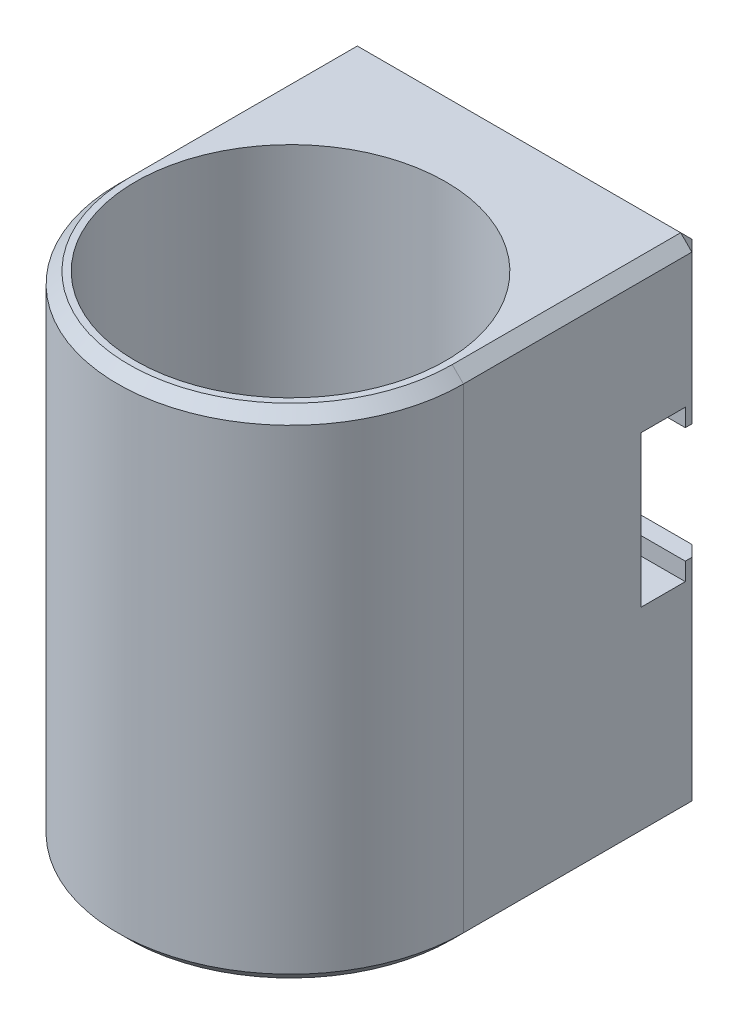
ISO-10303-21;
HEADER;
FILE_DESCRIPTION(('STEP AP214'),'2;1');
FILE_NAME('part.step','',(''),(''),'','','');
FILE_SCHEMA(('AUTOMOTIVE_DESIGN { 1 0 10303 214 1 1 1 1 }'));
ENDSEC;
DATA;
#1=APPLICATION_CONTEXT('core data for automotive mechanical design processes');
#2=APPLICATION_PROTOCOL_DEFINITION('international standard','automotive_design',2000,#1);
#3=PRODUCT_CONTEXT('',#1,'mechanical');
#4=PRODUCT('Part','Part','',(#3));
#5=PRODUCT_RELATED_PRODUCT_CATEGORY('part','',(#4));
#6=PRODUCT_DEFINITION_FORMATION('','',#4);
#7=PRODUCT_DEFINITION_CONTEXT('part definition',#1,'design');
#8=PRODUCT_DEFINITION('design','',#6,#7);
#9=PRODUCT_DEFINITION_SHAPE('','',#8);
#10=(LENGTH_UNIT() NAMED_UNIT(*) SI_UNIT(.MILLI.,.METRE.));
#11=(NAMED_UNIT(*) PLANE_ANGLE_UNIT() SI_UNIT($,.RADIAN.));
#12=(NAMED_UNIT(*) SI_UNIT($,.STERADIAN.) SOLID_ANGLE_UNIT());
#13=UNCERTAINTY_MEASURE_WITH_UNIT(LENGTH_MEASURE(1.E-05),#10,'distance_accuracy_value','');
#14=(GEOMETRIC_REPRESENTATION_CONTEXT(3) GLOBAL_UNCERTAINTY_ASSIGNED_CONTEXT((#13)) GLOBAL_UNIT_ASSIGNED_CONTEXT((#10,
#11,#12)) REPRESENTATION_CONTEXT('',''));
#15=CARTESIAN_POINT('',(0.,0.,0.));
#16=DIRECTION('',(0.,0.,1.));
#17=DIRECTION('',(1.,0.,0.));
#18=AXIS2_PLACEMENT_3D('',#15,#16,#17);
#19=CARTESIAN_POINT('',(-15.4375,44.45,-21.4));
#20=DIRECTION('',(0.,0.,1.));
#21=DIRECTION('',(1.,0.,0.));
#22=AXIS2_PLACEMENT_3D('',#19,#20,#21);
#23=PLANE('',#22);
#24=DIRECTION('',(-1.,0.,0.));
#25=VECTOR('',#24,1.);
#26=CARTESIAN_POINT('',(-15.4375,1.,-21.4));
#27=LINE('',#26,#25);
#28=CARTESIAN_POINT('',(14.4375,1.,-21.4));
#29=VERTEX_POINT('',#28);
#30=CARTESIAN_POINT('',(-14.4375,1.,-21.4));
#31=VERTEX_POINT('',#30);
#32=EDGE_CURVE('E268',#29,#31,#27,.T.);
#33=ORIENTED_EDGE('',*,*,#32,.T.);
#34=DIRECTION('',(0.,1.,0.));
#35=VECTOR('',#34,1.);
#36=CARTESIAN_POINT('',(-14.4375,44.45,-21.4));
#37=LINE('',#36,#35);
#38=CARTESIAN_POINT('',(-14.4375,19.84375,-21.4));
#39=VERTEX_POINT('',#38);
#40=EDGE_CURVE('E272',#31,#39,#37,.T.);
#41=ORIENTED_EDGE('',*,*,#40,.T.);
#42=DIRECTION('',(1.,0.,0.));
#43=VECTOR('',#42,1.);
#44=CARTESIAN_POINT('',(-15.4375,19.84375,-21.4));
#45=LINE('',#44,#43);
#46=CARTESIAN_POINT('',(14.4375,19.84375,-21.4));
#47=VERTEX_POINT('',#46);
#48=EDGE_CURVE('E234',#39,#47,#45,.T.);
#49=ORIENTED_EDGE('',*,*,#48,.T.);
#50=DIRECTION('',(0.,-1.,0.));
#51=VECTOR('',#50,1.);
#52=CARTESIAN_POINT('',(14.4375,44.45,-21.4));
#53=LINE('',#52,#51);
#54=EDGE_CURVE('E270',#47,#29,#53,.T.);
#55=ORIENTED_EDGE('',*,*,#54,.T.);
#56=EDGE_LOOP('',(#33,#41,#49,#55));
#57=FACE_BOUND('',#56,.T.);
#58=ADVANCED_FACE('F35',(#57),#23,.F.);
#59=CARTESIAN_POINT('',(0.,44.45,0.));
#60=DIRECTION('',(0.,-1.,0.));
#61=DIRECTION('',(0.,0.,-1.));
#62=AXIS2_PLACEMENT_3D('',#59,#60,#61);
#63=CYLINDRICAL_SURFACE('',#62,13.85);
#64=CARTESIAN_POINT('',(0.,44.45,0.));
#65=DIRECTION('',(0.,1.,0.));
#66=DIRECTION('',(0.,0.,1.));
#67=AXIS2_PLACEMENT_3D('',#64,#65,#66);
#68=CIRCLE('',#67,13.85);
#69=CARTESIAN_POINT('',(0.,44.45,13.85));
#70=VERTEX_POINT('',#69);
#71=EDGE_CURVE('E248',#70,#70,#68,.T.);
#72=ORIENTED_EDGE('',*,*,#71,.T.);
#73=EDGE_LOOP('',(#72));
#74=FACE_BOUND('',#73,.T.);
#75=CARTESIAN_POINT('',(0.,1.5875,0.));
#76=DIRECTION('',(0.,-1.,0.));
#77=DIRECTION('',(0.,0.,-1.));
#78=AXIS2_PLACEMENT_3D('',#75,#76,#77);
#79=CIRCLE('',#78,13.85);
#80=CARTESIAN_POINT('',(0.,1.5875,-13.85));
#81=VERTEX_POINT('',#80);
#82=EDGE_CURVE('E237',#81,#81,#79,.T.);
#83=ORIENTED_EDGE('',*,*,#82,.T.);
#84=EDGE_LOOP('',(#83));
#85=FACE_BOUND('',#84,.T.);
#86=ADVANCED_FACE('F433',(#74,#85),#63,.F.);
#87=CARTESIAN_POINT('',(0.,44.45,0.));
#88=DIRECTION('',(0.,1.,0.));
#89=DIRECTION('',(0.,0.,1.));
#90=AXIS2_PLACEMENT_3D('',#87,#88,#89);
#91=PLANE('',#90);
#92=DIRECTION('',(0.,0.,-1.));
#93=VECTOR('',#92,1.);
#94=CARTESIAN_POINT('',(14.4375,44.45,-21.4));
#95=LINE('',#94,#93);
#96=CARTESIAN_POINT('',(14.4375,44.45,0.));
#97=VERTEX_POINT('',#96);
#98=CARTESIAN_POINT('',(14.4375,44.45,-20.4));
#99=VERTEX_POINT('',#98);
#100=EDGE_CURVE('E309',#97,#99,#95,.T.);
#101=ORIENTED_EDGE('',*,*,#100,.T.);
#102=DIRECTION('',(-1.,0.,0.));
#103=VECTOR('',#102,1.);
#104=CARTESIAN_POINT('',(-15.4375,44.45,-20.4));
#105=LINE('',#104,#103);
#106=CARTESIAN_POINT('',(-14.4375,44.45,-20.4));
#107=VERTEX_POINT('',#106);
#108=EDGE_CURVE('E11',#99,#107,#105,.T.);
#109=ORIENTED_EDGE('',*,*,#108,.T.);
#110=DIRECTION('',(0.,0.,1.));
#111=VECTOR('',#110,1.);
#112=CARTESIAN_POINT('',(-14.4375,44.45,0.));
#113=LINE('',#112,#111);
#114=CARTESIAN_POINT('',(-14.4375,44.45,0.));
#115=VERTEX_POINT('',#114);
#116=EDGE_CURVE('E44',#107,#115,#113,.T.);
#117=ORIENTED_EDGE('',*,*,#116,.T.);
#118=CARTESIAN_POINT('',(0.,44.45,0.));
#119=DIRECTION('',(0.,1.,0.));
#120=DIRECTION('',(0.,0.,1.));
#121=AXIS2_PLACEMENT_3D('',#118,#119,#120);
#122=CIRCLE('',#121,14.4375);
#123=EDGE_CURVE('E311',#115,#97,#122,.T.);
#124=ORIENTED_EDGE('',*,*,#123,.T.);
#125=EDGE_LOOP('',(#101,#109,#117,#124));
#126=FACE_BOUND('',#125,.T.);
#127=ORIENTED_EDGE('',*,*,#71,.F.);
#128=EDGE_LOOP('',(#127));
#129=FACE_BOUND('',#128,.T.);
#130=ADVANCED_FACE('F364',(#126,#129),#91,.T.);
#131=CARTESIAN_POINT('',(0.,0.,0.));
#132=DIRECTION('',(0.,1.,0.));
#133=DIRECTION('',(0.,0.,1.));
#134=AXIS2_PLACEMENT_3D('',#131,#132,#133);
#135=PLANE('',#134);
#136=DIRECTION('',(0.,0.,-1.));
#137=VECTOR('',#136,1.);
#138=CARTESIAN_POINT('',(-14.4375,0.,0.));
#139=LINE('',#138,#137);
#140=CARTESIAN_POINT('',(-14.4375,0.,0.));
#141=VERTEX_POINT('',#140);
#142=CARTESIAN_POINT('',(-14.4375,0.,-20.4));
#143=VERTEX_POINT('',#142);
#144=EDGE_CURVE('E290',#141,#143,#139,.T.);
#145=ORIENTED_EDGE('',*,*,#144,.T.);
#146=DIRECTION('',(1.,0.,0.));
#147=VECTOR('',#146,1.);
#148=CARTESIAN_POINT('',(0.,0.,-20.4));
#149=LINE('',#148,#147);
#150=CARTESIAN_POINT('',(14.4375,0.,-20.4));
#151=VERTEX_POINT('',#150);
#152=EDGE_CURVE('E292',#143,#151,#149,.T.);
#153=ORIENTED_EDGE('',*,*,#152,.T.);
#154=DIRECTION('',(0.,0.,1.));
#155=VECTOR('',#154,1.);
#156=CARTESIAN_POINT('',(14.4375,0.,0.));
#157=LINE('',#156,#155);
#158=CARTESIAN_POINT('',(14.4375,0.,0.));
#159=VERTEX_POINT('',#158);
#160=EDGE_CURVE('E286',#151,#159,#157,.T.);
#161=ORIENTED_EDGE('',*,*,#160,.T.);
#162=CARTESIAN_POINT('',(0.,0.,0.));
#163=DIRECTION('',(0.,1.,0.));
#164=DIRECTION('',(0.,0.,1.));
#165=AXIS2_PLACEMENT_3D('',#162,#163,#164);
#166=CIRCLE('',#165,14.4375);
#167=EDGE_CURVE('E288',#159,#141,#166,.F.);
#168=ORIENTED_EDGE('',*,*,#167,.T.);
#169=EDGE_LOOP('',(#145,#153,#161,#168));
#170=FACE_BOUND('',#169,.T.);
#171=ADVANCED_FACE('F393',(#170),#135,.F.);
#172=CARTESIAN_POINT('',(0.,44.45,0.));
#173=DIRECTION('',(0.,-1.,0.));
#174=DIRECTION('',(0.,0.,-1.));
#175=AXIS2_PLACEMENT_3D('',#172,#173,#174);
#176=CYLINDRICAL_SURFACE('',#175,15.4375);
#177=DIRECTION('',(0.,-1.,0.));
#178=VECTOR('',#177,1.);
#179=CARTESIAN_POINT('',(-15.4375,44.45,0.));
#180=LINE('',#179,#178);
#181=CARTESIAN_POINT('',(-15.4375,43.45,0.));
#182=VERTEX_POINT('',#181);
#183=CARTESIAN_POINT('',(-15.4375,1.,0.));
#184=VERTEX_POINT('',#183);
#185=EDGE_CURVE('E251',#182,#184,#180,.T.);
#186=ORIENTED_EDGE('',*,*,#185,.T.);
#187=CARTESIAN_POINT('',(0.,1.,0.));
#188=DIRECTION('',(0.,1.,0.));
#189=DIRECTION('',(0.,0.,1.));
#190=AXIS2_PLACEMENT_3D('',#187,#188,#189);
#191=CIRCLE('',#190,15.4375);
#192=CARTESIAN_POINT('',(15.4375,1.,0.));
#193=VERTEX_POINT('',#192);
#194=EDGE_CURVE('E297',#184,#193,#191,.T.);
#195=ORIENTED_EDGE('',*,*,#194,.T.);
#196=DIRECTION('',(0.,-1.,0.));
#197=VECTOR('',#196,1.);
#198=CARTESIAN_POINT('',(15.4375,44.45,0.));
#199=LINE('',#198,#197);
#200=CARTESIAN_POINT('',(15.4375,43.45,0.));
#201=VERTEX_POINT('',#200);
#202=EDGE_CURVE('E254',#201,#193,#199,.T.);
#203=ORIENTED_EDGE('',*,*,#202,.F.);
#204=CARTESIAN_POINT('',(0.,43.45,0.));
#205=DIRECTION('',(0.,1.,0.));
#206=DIRECTION('',(0.,0.,1.));
#207=AXIS2_PLACEMENT_3D('',#204,#205,#206);
#208=CIRCLE('',#207,15.4375);
#209=EDGE_CURVE('E295',#201,#182,#208,.F.);
#210=ORIENTED_EDGE('',*,*,#209,.T.);
#211=EDGE_LOOP('',(#186,#195,#203,#210));
#212=FACE_BOUND('',#211,.T.);
#213=ADVANCED_FACE('F378',(#212),#176,.T.);
#214=CARTESIAN_POINT('',(15.4375,44.45,-21.4));
#215=DIRECTION('',(-1.,0.,0.));
#216=DIRECTION('',(0.,0.,1.));
#217=AXIS2_PLACEMENT_3D('',#214,#215,#216);
#218=PLANE('',#217);
#219=DIRECTION('',(0.,0.,-1.));
#220=VECTOR('',#219,1.);
#221=CARTESIAN_POINT('',(15.4375,1.,-21.4));
#222=LINE('',#221,#220);
#223=CARTESIAN_POINT('',(15.4375,1.,-20.4));
#224=VERTEX_POINT('',#223);
#225=EDGE_CURVE('E282',#193,#224,#222,.T.);
#226=ORIENTED_EDGE('',*,*,#225,.T.);
#227=DIRECTION('',(0.,1.,0.));
#228=VECTOR('',#227,1.);
#229=CARTESIAN_POINT('',(15.4375,44.45,-20.4));
#230=LINE('',#229,#228);
#231=CARTESIAN_POINT('',(15.4375,19.84375,-20.4));
#232=VERTEX_POINT('',#231);
#233=EDGE_CURVE('E284',#224,#232,#230,.T.);
#234=ORIENTED_EDGE('',*,*,#233,.T.);
#235=DIRECTION('',(0.,0.,-1.));
#236=VECTOR('',#235,1.);
#237=CARTESIAN_POINT('',(15.4375,19.84375,-19.8125));
#238=LINE('',#237,#236);
#239=CARTESIAN_POINT('',(15.4375,19.84375,-19.8125));
#240=VERTEX_POINT('',#239);
#241=EDGE_CURVE('E204',#240,#232,#238,.T.);
#242=ORIENTED_EDGE('',*,*,#241,.F.);
#243=DIRECTION('',(0.,1.,0.));
#244=VECTOR('',#243,1.);
#245=CARTESIAN_POINT('',(15.4375,18.25625,-19.8125));
#246=LINE('',#245,#244);
#247=CARTESIAN_POINT('',(15.4375,18.25625,-19.8125));
#248=VERTEX_POINT('',#247);
#249=EDGE_CURVE('E229',#248,#240,#246,.T.);
#250=ORIENTED_EDGE('',*,*,#249,.F.);
#251=DIRECTION('',(0.,0.,-1.));
#252=VECTOR('',#251,1.);
#253=CARTESIAN_POINT('',(15.4375,18.25625,-15.84375));
#254=LINE('',#253,#252);
#255=CARTESIAN_POINT('',(15.4375,18.25625,-15.84375));
#256=VERTEX_POINT('',#255);
#257=EDGE_CURVE('E226',#256,#248,#254,.T.);
#258=ORIENTED_EDGE('',*,*,#257,.F.);
#259=DIRECTION('',(0.,-1.,0.));
#260=VECTOR('',#259,1.);
#261=CARTESIAN_POINT('',(15.4375,31.75,-15.84375));
#262=LINE('',#261,#260);
#263=CARTESIAN_POINT('',(15.4375,31.75,-15.84375));
#264=VERTEX_POINT('',#263);
#265=EDGE_CURVE('E223',#264,#256,#262,.T.);
#266=ORIENTED_EDGE('',*,*,#265,.F.);
#267=DIRECTION('',(0.,0.,1.));
#268=VECTOR('',#267,1.);
#269=CARTESIAN_POINT('',(15.4375,31.75,-19.8125));
#270=LINE('',#269,#268);
#271=CARTESIAN_POINT('',(15.4375,31.75,-19.8125));
#272=VERTEX_POINT('',#271);
#273=EDGE_CURVE('E221',#272,#264,#270,.T.);
#274=ORIENTED_EDGE('',*,*,#273,.F.);
#275=DIRECTION('',(0.,1.,0.));
#276=VECTOR('',#275,1.);
#277=CARTESIAN_POINT('',(15.4375,30.1625,-19.8125));
#278=LINE('',#277,#276);
#279=CARTESIAN_POINT('',(15.4375,30.1625,-19.8125));
#280=VERTEX_POINT('',#279);
#281=EDGE_CURVE('E183',#280,#272,#278,.T.);
#282=ORIENTED_EDGE('',*,*,#281,.F.);
#283=DIRECTION('',(0.,0.,1.));
#284=VECTOR('',#283,1.);
#285=CARTESIAN_POINT('',(15.4375,30.1625,-21.4));
#286=LINE('',#285,#284);
#287=CARTESIAN_POINT('',(15.4375,30.1625,-20.4));
#288=VERTEX_POINT('',#287);
#289=EDGE_CURVE('E217',#288,#280,#286,.T.);
#290=ORIENTED_EDGE('',*,*,#289,.F.);
#291=DIRECTION('',(0.,1.,0.));
#292=VECTOR('',#291,1.);
#293=CARTESIAN_POINT('',(15.4375,44.45,-20.4));
#294=LINE('',#293,#292);
#295=CARTESIAN_POINT('',(15.4375,43.45,-20.4));
#296=VERTEX_POINT('',#295);
#297=EDGE_CURVE('E280',#288,#296,#294,.T.);
#298=ORIENTED_EDGE('',*,*,#297,.T.);
#299=DIRECTION('',(0.,0.,1.));
#300=VECTOR('',#299,1.);
#301=CARTESIAN_POINT('',(15.4375,43.45,0.));
#302=LINE('',#301,#300);
#303=EDGE_CURVE('E278',#296,#201,#302,.T.);
#304=ORIENTED_EDGE('',*,*,#303,.T.);
#305=ORIENTED_EDGE('',*,*,#202,.T.);
#306=EDGE_LOOP('',(#226,#234,#242,#250,#258,#266,#274,#282,#290,#298,#304,#305));
#307=FACE_BOUND('',#306,.T.);
#308=ADVANCED_FACE('F374',(#307),#218,.F.);
#309=DIRECTION('',(1.,0.,0.));
#310=VECTOR('',#309,1.);
#311=CARTESIAN_POINT('',(-15.4375,30.1625,-21.4));
#312=LINE('',#311,#310);
#313=CARTESIAN_POINT('',(-14.4375,30.1625,-21.4));
#314=VERTEX_POINT('',#313);
#315=CARTESIAN_POINT('',(14.4375,30.1625,-21.4));
#316=VERTEX_POINT('',#315);
#317=EDGE_CURVE('E216',#314,#316,#312,.T.);
#318=ORIENTED_EDGE('',*,*,#317,.F.);
#319=DIRECTION('',(0.,1.,0.));
#320=VECTOR('',#319,1.);
#321=CARTESIAN_POINT('',(-14.4375,44.45,-21.4));
#322=LINE('',#321,#320);
#323=CARTESIAN_POINT('',(-14.4375,43.45,-21.4));
#324=VERTEX_POINT('',#323);
#325=EDGE_CURVE('E307',#314,#324,#322,.T.);
#326=ORIENTED_EDGE('',*,*,#325,.T.);
#327=DIRECTION('',(1.,0.,0.));
#328=VECTOR('',#327,1.);
#329=CARTESIAN_POINT('',(15.4375,43.45,-21.4));
#330=LINE('',#329,#328);
#331=CARTESIAN_POINT('',(14.4375,43.45,-21.4));
#332=VERTEX_POINT('',#331);
#333=EDGE_CURVE('E303',#324,#332,#330,.T.);
#334=ORIENTED_EDGE('',*,*,#333,.T.);
#335=DIRECTION('',(0.,-1.,0.));
#336=VECTOR('',#335,1.);
#337=CARTESIAN_POINT('',(14.4375,44.45,-21.4));
#338=LINE('',#337,#336);
#339=EDGE_CURVE('E305',#332,#316,#338,.T.);
#340=ORIENTED_EDGE('',*,*,#339,.T.);
#341=EDGE_LOOP('',(#318,#326,#334,#340));
#342=FACE_BOUND('',#341,.T.);
#343=ADVANCED_FACE('F435',(#342),#23,.F.);
#344=CARTESIAN_POINT('',(-15.4375,44.45,0.));
#345=DIRECTION('',(1.,0.,0.));
#346=DIRECTION('',(0.,0.,-1.));
#347=AXIS2_PLACEMENT_3D('',#344,#345,#346);
#348=PLANE('',#347);
#349=DIRECTION('',(0.,0.,-1.));
#350=VECTOR('',#349,1.);
#351=CARTESIAN_POINT('',(-15.4375,19.84375,-19.8125));
#352=LINE('',#351,#350);
#353=CARTESIAN_POINT('',(-15.4375,19.84375,-19.8125));
#354=VERTEX_POINT('',#353);
#355=CARTESIAN_POINT('',(-15.4375,19.84375,-20.4));
#356=VERTEX_POINT('',#355);
#357=EDGE_CURVE('E214',#354,#356,#352,.T.);
#358=ORIENTED_EDGE('',*,*,#357,.T.);
#359=DIRECTION('',(0.,-1.,0.));
#360=VECTOR('',#359,1.);
#361=CARTESIAN_POINT('',(-15.4375,44.45,-20.4));
#362=LINE('',#361,#360);
#363=CARTESIAN_POINT('',(-15.4375,1.,-20.4));
#364=VERTEX_POINT('',#363);
#365=EDGE_CURVE('E265',#356,#364,#362,.T.);
#366=ORIENTED_EDGE('',*,*,#365,.T.);
#367=DIRECTION('',(0.,0.,1.));
#368=VECTOR('',#367,1.);
#369=CARTESIAN_POINT('',(-15.4375,1.,0.));
#370=LINE('',#369,#368);
#371=EDGE_CURVE('E263',#364,#184,#370,.T.);
#372=ORIENTED_EDGE('',*,*,#371,.T.);
#373=ORIENTED_EDGE('',*,*,#185,.F.);
#374=DIRECTION('',(0.,0.,-1.));
#375=VECTOR('',#374,1.);
#376=CARTESIAN_POINT('',(-15.4375,43.45,-21.4));
#377=LINE('',#376,#375);
#378=CARTESIAN_POINT('',(-15.4375,43.45,-20.4));
#379=VERTEX_POINT('',#378);
#380=EDGE_CURVE('E257',#182,#379,#377,.T.);
#381=ORIENTED_EDGE('',*,*,#380,.T.);
#382=DIRECTION('',(0.,-1.,0.));
#383=VECTOR('',#382,1.);
#384=CARTESIAN_POINT('',(-15.4375,44.45,-20.4));
#385=LINE('',#384,#383);
#386=CARTESIAN_POINT('',(-15.4375,30.1625,-20.4));
#387=VERTEX_POINT('',#386);
#388=EDGE_CURVE('E261',#379,#387,#385,.T.);
#389=ORIENTED_EDGE('',*,*,#388,.T.);
#390=DIRECTION('',(0.,0.,1.));
#391=VECTOR('',#390,1.);
#392=CARTESIAN_POINT('',(-15.4375,30.1625,-21.4));
#393=LINE('',#392,#391);
#394=CARTESIAN_POINT('',(-15.4375,30.1625,-19.8125));
#395=VERTEX_POINT('',#394);
#396=EDGE_CURVE('E202',#387,#395,#393,.T.);
#397=ORIENTED_EDGE('',*,*,#396,.T.);
#398=DIRECTION('',(0.,1.,0.));
#399=VECTOR('',#398,1.);
#400=CARTESIAN_POINT('',(-15.4375,30.1625,-19.8125));
#401=LINE('',#400,#399);
#402=CARTESIAN_POINT('',(-15.4375,31.75,-19.8125));
#403=VERTEX_POINT('',#402);
#404=EDGE_CURVE('E180',#395,#403,#401,.T.);
#405=ORIENTED_EDGE('',*,*,#404,.T.);
#406=DIRECTION('',(0.,0.,1.));
#407=VECTOR('',#406,1.);
#408=CARTESIAN_POINT('',(-15.4375,31.75,-19.8125));
#409=LINE('',#408,#407);
#410=CARTESIAN_POINT('',(-15.4375,31.75,-15.84375));
#411=VERTEX_POINT('',#410);
#412=EDGE_CURVE('E191',#403,#411,#409,.T.);
#413=ORIENTED_EDGE('',*,*,#412,.T.);
#414=DIRECTION('',(0.,-1.,0.));
#415=VECTOR('',#414,1.);
#416=CARTESIAN_POINT('',(-15.4375,31.75,-15.84375));
#417=LINE('',#416,#415);
#418=CARTESIAN_POINT('',(-15.4375,18.25625,-15.84375));
#419=VERTEX_POINT('',#418);
#420=EDGE_CURVE('E196',#411,#419,#417,.T.);
#421=ORIENTED_EDGE('',*,*,#420,.T.);
#422=DIRECTION('',(0.,0.,-1.));
#423=VECTOR('',#422,1.);
#424=CARTESIAN_POINT('',(-15.4375,18.25625,-15.84375));
#425=LINE('',#424,#423);
#426=CARTESIAN_POINT('',(-15.4375,18.25625,-19.8125));
#427=VERTEX_POINT('',#426);
#428=EDGE_CURVE('E208',#419,#427,#425,.T.);
#429=ORIENTED_EDGE('',*,*,#428,.T.);
#430=DIRECTION('',(0.,1.,0.));
#431=VECTOR('',#430,1.);
#432=CARTESIAN_POINT('',(-15.4375,18.25625,-19.8125));
#433=LINE('',#432,#431);
#434=EDGE_CURVE('E211',#427,#354,#433,.T.);
#435=ORIENTED_EDGE('',*,*,#434,.T.);
#436=EDGE_LOOP('',(#358,#366,#372,#373,#381,#389,#397,#405,#413,#421,#429,#435));
#437=FACE_BOUND('',#436,.T.);
#438=ADVANCED_FACE('F199',(#437),#348,.F.);
#439=CARTESIAN_POINT('',(0.,1.5875,0.));
#440=DIRECTION('',(0.,-1.,0.));
#441=DIRECTION('',(0.,0.,-1.));
#442=AXIS2_PLACEMENT_3D('',#439,#440,#441);
#443=PLANE('',#442);
#444=ORIENTED_EDGE('',*,*,#82,.F.);
#445=EDGE_LOOP('',(#444));
#446=FACE_BOUND('',#445,.T.);
#447=ADVANCED_FACE('F451',(#446),#443,.F.);
#448=CARTESIAN_POINT('',(-15.4375,19.84375,-19.8125));
#449=DIRECTION('',(0.,-1.,0.));
#450=DIRECTION('',(0.,0.,-1.));
#451=AXIS2_PLACEMENT_3D('',#448,#449,#450);
#452=PLANE('',#451);
#453=ORIENTED_EDGE('',*,*,#48,.F.);
#454=DIRECTION('',(0.70710678118655,0.,-0.707106781186545));
#455=VECTOR('',#454,1.);
#456=CARTESIAN_POINT('',(-15.4375,19.84375,-20.4));
#457=LINE('',#456,#455);
#458=EDGE_CURVE('E276',#39,#356,#457,.F.);
#459=ORIENTED_EDGE('',*,*,#458,.T.);
#460=ORIENTED_EDGE('',*,*,#357,.F.);
#461=DIRECTION('',(1.,0.,0.));
#462=VECTOR('',#461,1.);
#463=CARTESIAN_POINT('',(-15.4375,19.84375,-19.8125));
#464=LINE('',#463,#462);
#465=EDGE_CURVE('E238',#354,#240,#464,.T.);
#466=ORIENTED_EDGE('',*,*,#465,.T.);
#467=ORIENTED_EDGE('',*,*,#241,.T.);
#468=DIRECTION('',(0.70710678118655,0.,0.707106781186545));
#469=VECTOR('',#468,1.);
#470=CARTESIAN_POINT('',(14.4375,19.84375,-21.4));
#471=LINE('',#470,#469);
#472=EDGE_CURVE('E274',#232,#47,#471,.F.);
#473=ORIENTED_EDGE('',*,*,#472,.T.);
#474=EDGE_LOOP('',(#453,#459,#460,#466,#467,#473));
#475=FACE_BOUND('',#474,.T.);
#476=ADVANCED_FACE('F415',(#475),#452,.F.);
#477=CARTESIAN_POINT('',(-15.4375,18.25625,-19.8125));
#478=DIRECTION('',(0.,0.,-1.));
#479=DIRECTION('',(-1.,0.,0.));
#480=AXIS2_PLACEMENT_3D('',#477,#478,#479);
#481=PLANE('',#480);
#482=ORIENTED_EDGE('',*,*,#249,.T.);
#483=ORIENTED_EDGE('',*,*,#465,.F.);
#484=ORIENTED_EDGE('',*,*,#434,.F.);
#485=DIRECTION('',(1.,0.,0.));
#486=VECTOR('',#485,1.);
#487=CARTESIAN_POINT('',(-15.4375,18.25625,-19.8125));
#488=LINE('',#487,#486);
#489=EDGE_CURVE('E240',#427,#248,#488,.T.);
#490=ORIENTED_EDGE('',*,*,#489,.T.);
#491=EDGE_LOOP('',(#482,#483,#484,#490));
#492=FACE_BOUND('',#491,.T.);
#493=ADVANCED_FACE('F496',(#492),#481,.F.);
#494=CARTESIAN_POINT('',(-15.4375,18.25625,-15.84375));
#495=DIRECTION('',(0.,-1.,0.));
#496=DIRECTION('',(0.,0.,-1.));
#497=AXIS2_PLACEMENT_3D('',#494,#495,#496);
#498=PLANE('',#497);
#499=ORIENTED_EDGE('',*,*,#257,.T.);
#500=ORIENTED_EDGE('',*,*,#489,.F.);
#501=ORIENTED_EDGE('',*,*,#428,.F.);
#502=DIRECTION('',(1.,0.,0.));
#503=VECTOR('',#502,1.);
#504=CARTESIAN_POINT('',(-15.4375,18.25625,-15.84375));
#505=LINE('',#504,#503);
#506=EDGE_CURVE('E242',#419,#256,#505,.T.);
#507=ORIENTED_EDGE('',*,*,#506,.T.);
#508=EDGE_LOOP('',(#499,#500,#501,#507));
#509=FACE_BOUND('',#508,.T.);
#510=ADVANCED_FACE('F494',(#509),#498,.F.);
#511=CARTESIAN_POINT('',(-15.4375,31.75,-15.84375));
#512=DIRECTION('',(0.,0.,1.));
#513=DIRECTION('',(0.,-1.,0.));
#514=AXIS2_PLACEMENT_3D('',#511,#512,#513);
#515=PLANE('',#514);
#516=ORIENTED_EDGE('',*,*,#265,.T.);
#517=ORIENTED_EDGE('',*,*,#506,.F.);
#518=ORIENTED_EDGE('',*,*,#420,.F.);
#519=DIRECTION('',(1.,0.,0.));
#520=VECTOR('',#519,1.);
#521=CARTESIAN_POINT('',(-15.4375,31.75,-15.84375));
#522=LINE('',#521,#520);
#523=EDGE_CURVE('E187',#411,#264,#522,.T.);
#524=ORIENTED_EDGE('',*,*,#523,.T.);
#525=EDGE_LOOP('',(#516,#517,#518,#524));
#526=FACE_BOUND('',#525,.T.);
#527=ADVANCED_FACE('F490',(#526),#515,.F.);
#528=CARTESIAN_POINT('',(-15.4375,31.75,-19.8125));
#529=DIRECTION('',(0.,1.,0.));
#530=DIRECTION('',(0.,0.,1.));
#531=AXIS2_PLACEMENT_3D('',#528,#529,#530);
#532=PLANE('',#531);
#533=ORIENTED_EDGE('',*,*,#273,.T.);
#534=ORIENTED_EDGE('',*,*,#523,.F.);
#535=ORIENTED_EDGE('',*,*,#412,.F.);
#536=DIRECTION('',(1.,0.,0.));
#537=VECTOR('',#536,1.);
#538=CARTESIAN_POINT('',(-15.4375,31.75,-19.8125));
#539=LINE('',#538,#537);
#540=EDGE_CURVE('E175',#403,#272,#539,.T.);
#541=ORIENTED_EDGE('',*,*,#540,.T.);
#542=EDGE_LOOP('',(#533,#534,#535,#541));
#543=FACE_BOUND('',#542,.T.);
#544=ADVANCED_FACE('F192',(#543),#532,.F.);
#545=CARTESIAN_POINT('',(-15.4375,30.1625,-19.8125));
#546=DIRECTION('',(0.,0.,-1.));
#547=DIRECTION('',(-1.,0.,0.));
#548=AXIS2_PLACEMENT_3D('',#545,#546,#547);
#549=PLANE('',#548);
#550=ORIENTED_EDGE('',*,*,#281,.T.);
#551=ORIENTED_EDGE('',*,*,#540,.F.);
#552=ORIENTED_EDGE('',*,*,#404,.F.);
#553=DIRECTION('',(1.,0.,0.));
#554=VECTOR('',#553,1.);
#555=CARTESIAN_POINT('',(-15.4375,30.1625,-19.8125));
#556=LINE('',#555,#554);
#557=EDGE_CURVE('E188',#395,#280,#556,.T.);
#558=ORIENTED_EDGE('',*,*,#557,.T.);
#559=EDGE_LOOP('',(#550,#551,#552,#558));
#560=FACE_BOUND('',#559,.T.);
#561=ADVANCED_FACE('F177',(#560),#549,.F.);
#562=CARTESIAN_POINT('',(-15.4375,30.1625,-21.4));
#563=DIRECTION('',(0.,1.,0.));
#564=DIRECTION('',(0.,0.,1.));
#565=AXIS2_PLACEMENT_3D('',#562,#563,#564);
#566=PLANE('',#565);
#567=ORIENTED_EDGE('',*,*,#396,.F.);
#568=DIRECTION('',(-0.70710678118655,0.,0.707106781186545));
#569=VECTOR('',#568,1.);
#570=CARTESIAN_POINT('',(-15.4375,30.1625,-20.4));
#571=LINE('',#570,#569);
#572=EDGE_CURVE('E301',#387,#314,#571,.F.);
#573=ORIENTED_EDGE('',*,*,#572,.T.);
#574=ORIENTED_EDGE('',*,*,#317,.T.);
#575=DIRECTION('',(-0.707106781186545,0.,-0.70710678118655));
#576=VECTOR('',#575,1.);
#577=CARTESIAN_POINT('',(14.4375,30.1625,-21.4));
#578=LINE('',#577,#576);
#579=EDGE_CURVE('E299',#316,#288,#578,.F.);
#580=ORIENTED_EDGE('',*,*,#579,.T.);
#581=ORIENTED_EDGE('',*,*,#289,.T.);
#582=ORIENTED_EDGE('',*,*,#557,.F.);
#583=EDGE_LOOP('',(#567,#573,#574,#580,#581,#582));
#584=FACE_BOUND('',#583,.T.);
#585=ADVANCED_FACE('F485',(#584),#566,.F.);
#586=CARTESIAN_POINT('',(15.4375,1.,-21.4));
#587=DIRECTION('',(-0.707106781186545,0.70710678118655,0.));
#588=DIRECTION('',(0.,0.,-1.));
#589=AXIS2_PLACEMENT_3D('',#586,#587,#588);
#590=PLANE('',#589);
#591=DIRECTION('',(0.70710678118655,0.707106781186545,0.));
#592=VECTOR('',#591,1.);
#593=CARTESIAN_POINT('',(14.9375,0.5,-20.4));
#594=LINE('',#593,#592);
#595=EDGE_CURVE('E330',#224,#151,#594,.F.);
#596=ORIENTED_EDGE('',*,*,#595,.F.);
#597=ORIENTED_EDGE('',*,*,#225,.F.);
#598=DIRECTION('',(0.70710678118655,0.707106781186545,0.));
#599=VECTOR('',#598,1.);
#600=CARTESIAN_POINT('',(14.4375,0.,0.));
#601=LINE('',#600,#599);
#602=EDGE_CURVE('E219',#159,#193,#601,.T.);
#603=ORIENTED_EDGE('',*,*,#602,.F.);
#604=ORIENTED_EDGE('',*,*,#160,.F.);
#605=EDGE_LOOP('',(#596,#597,#603,#604));
#606=FACE_BOUND('',#605,.T.);
#607=ADVANCED_FACE('F406',(#606),#590,.F.);
#608=CARTESIAN_POINT('',(14.4375,44.45,-21.4));
#609=DIRECTION('',(-0.707106781186545,0.,0.70710678118655));
#610=DIRECTION('',(0.,-1.,0.));
#611=AXIS2_PLACEMENT_3D('',#608,#609,#610);
#612=PLANE('',#611);
#613=ORIENTED_EDGE('',*,*,#472,.F.);
#614=ORIENTED_EDGE('',*,*,#233,.F.);
#615=DIRECTION('',(-0.70710678118655,0.,-0.707106781186545));
#616=VECTOR('',#615,1.);
#617=CARTESIAN_POINT('',(14.4375,1.,-21.4));
#618=LINE('',#617,#616);
#619=EDGE_CURVE('E327',#29,#224,#618,.F.);
#620=ORIENTED_EDGE('',*,*,#619,.F.);
#621=ORIENTED_EDGE('',*,*,#54,.F.);
#622=EDGE_LOOP('',(#613,#614,#620,#621));
#623=FACE_BOUND('',#622,.T.);
#624=ADVANCED_FACE('F411',(#623),#612,.F.);
#625=CARTESIAN_POINT('',(0.,1.,0.));
#626=DIRECTION('',(0.,1.,0.));
#627=DIRECTION('',(0.,0.,1.));
#628=AXIS2_PLACEMENT_3D('',#625,#626,#627);
#629=CONICAL_SURFACE('',#628,15.4375,0.785398163397452);
#630=ORIENTED_EDGE('',*,*,#602,.T.);
#631=ORIENTED_EDGE('',*,*,#194,.F.);
#632=DIRECTION('',(-0.70710678118655,0.707106781186545,0.));
#633=VECTOR('',#632,1.);
#634=CARTESIAN_POINT('',(-14.4375,0.,0.));
#635=LINE('',#634,#633);
#636=EDGE_CURVE('E324',#141,#184,#635,.T.);
#637=ORIENTED_EDGE('',*,*,#636,.F.);
#638=ORIENTED_EDGE('',*,*,#167,.F.);
#639=EDGE_LOOP('',(#630,#631,#637,#638));
#640=FACE_BOUND('',#639,.T.);
#641=ADVANCED_FACE('F383',(#640),#629,.T.);
#642=CARTESIAN_POINT('',(14.4375,1.,-21.4));
#643=DIRECTION('',(0.577350269189622,-0.57735026918963,-0.577350269189626));
#644=DIRECTION('',(0.,0.707106781186545,-0.70710678118655));
#645=AXIS2_PLACEMENT_3D('',#642,#643,#644);
#646=PLANE('',#645);
#647=ORIENTED_EDGE('',*,*,#619,.T.);
#648=ORIENTED_EDGE('',*,*,#595,.T.);
#649=DIRECTION('',(0.,-0.707106781186545,0.70710678118655));
#650=VECTOR('',#649,1.);
#651=CARTESIAN_POINT('',(14.4375,1.,-21.4));
#652=LINE('',#651,#650);
#653=EDGE_CURVE('E322',#29,#151,#652,.T.);
#654=ORIENTED_EDGE('',*,*,#653,.F.);
#655=EDGE_LOOP('',(#647,#648,#654));
#656=FACE_BOUND('',#655,.T.);
#657=ADVANCED_FACE('F403',(#656),#646,.T.);
#658=CARTESIAN_POINT('',(-15.4375,1.,0.));
#659=DIRECTION('',(0.707106781186545,0.70710678118655,0.));
#660=DIRECTION('',(0.,0.,1.));
#661=AXIS2_PLACEMENT_3D('',#658,#659,#660);
#662=PLANE('',#661);
#663=ORIENTED_EDGE('',*,*,#636,.T.);
#664=ORIENTED_EDGE('',*,*,#371,.F.);
#665=DIRECTION('',(0.70710678118655,-0.707106781186545,0.));
#666=VECTOR('',#665,1.);
#667=CARTESIAN_POINT('',(-15.4375,1.,-20.4));
#668=LINE('',#667,#666);
#669=EDGE_CURVE('E319',#143,#364,#668,.F.);
#670=ORIENTED_EDGE('',*,*,#669,.F.);
#671=ORIENTED_EDGE('',*,*,#144,.F.);
#672=EDGE_LOOP('',(#663,#664,#670,#671));
#673=FACE_BOUND('',#672,.T.);
#674=ADVANCED_FACE('F389',(#673),#662,.F.);
#675=CARTESIAN_POINT('',(-15.4375,1.,-21.4));
#676=DIRECTION('',(0.,0.70710678118655,0.707106781186545));
#677=DIRECTION('',(-1.,0.,0.));
#678=AXIS2_PLACEMENT_3D('',#675,#676,#677);
#679=PLANE('',#678);
#680=ORIENTED_EDGE('',*,*,#653,.T.);
#681=ORIENTED_EDGE('',*,*,#152,.F.);
#682=DIRECTION('',(0.,0.707106781186545,-0.70710678118655));
#683=VECTOR('',#682,1.);
#684=CARTESIAN_POINT('',(-14.4375,0.500000000000001,-20.9));
#685=LINE('',#684,#683);
#686=EDGE_CURVE('E316',#31,#143,#685,.F.);
#687=ORIENTED_EDGE('',*,*,#686,.F.);
#688=ORIENTED_EDGE('',*,*,#32,.F.);
#689=EDGE_LOOP('',(#680,#681,#687,#688));
#690=FACE_BOUND('',#689,.T.);
#691=ADVANCED_FACE('F396',(#690),#679,.F.);
#692=CARTESIAN_POINT('',(-15.4375,1.,-20.4));
#693=DIRECTION('',(-0.577350269189622,-0.57735026918963,-0.577350269189626));
#694=DIRECTION('',(0.,0.707106781186545,-0.70710678118655));
#695=AXIS2_PLACEMENT_3D('',#692,#693,#694);
#696=PLANE('',#695);
#697=ORIENTED_EDGE('',*,*,#686,.T.);
#698=ORIENTED_EDGE('',*,*,#669,.T.);
#699=DIRECTION('',(-0.70710678118655,0.,0.707106781186545));
#700=VECTOR('',#699,1.);
#701=CARTESIAN_POINT('',(-15.4375,1.,-20.4));
#702=LINE('',#701,#700);
#703=EDGE_CURVE('E314',#31,#364,#702,.T.);
#704=ORIENTED_EDGE('',*,*,#703,.F.);
#705=EDGE_LOOP('',(#697,#698,#704));
#706=FACE_BOUND('',#705,.T.);
#707=ADVANCED_FACE('F423',(#706),#696,.T.);
#708=CARTESIAN_POINT('',(-15.4375,44.45,-20.4));
#709=DIRECTION('',(0.707106781186545,0.,0.70710678118655));
#710=DIRECTION('',(0.,-1.,0.));
#711=AXIS2_PLACEMENT_3D('',#708,#709,#710);
#712=PLANE('',#711);
#713=ORIENTED_EDGE('',*,*,#458,.F.);
#714=ORIENTED_EDGE('',*,*,#40,.F.);
#715=ORIENTED_EDGE('',*,*,#703,.T.);
#716=ORIENTED_EDGE('',*,*,#365,.F.);
#717=EDGE_LOOP('',(#713,#714,#715,#716));
#718=FACE_BOUND('',#717,.T.);
#719=ADVANCED_FACE('F420',(#718),#712,.F.);
#720=CARTESIAN_POINT('',(14.4375,44.45,-21.4));
#721=DIRECTION('',(-0.70710678118655,0.,0.707106781186545));
#722=DIRECTION('',(0.,-1.,0.));
#723=AXIS2_PLACEMENT_3D('',#720,#721,#722);
#724=PLANE('',#723);
#725=ORIENTED_EDGE('',*,*,#579,.F.);
#726=ORIENTED_EDGE('',*,*,#339,.F.);
#727=DIRECTION('',(0.707106781186545,0.,0.70710678118655));
#728=VECTOR('',#727,1.);
#729=CARTESIAN_POINT('',(15.4375,43.45,-20.4));
#730=LINE('',#729,#728);
#731=EDGE_CURVE('E39',#296,#332,#730,.F.);
#732=ORIENTED_EDGE('',*,*,#731,.F.);
#733=ORIENTED_EDGE('',*,*,#297,.F.);
#734=EDGE_LOOP('',(#725,#726,#732,#733));
#735=FACE_BOUND('',#734,.T.);
#736=ADVANCED_FACE('F37',(#735),#724,.F.);
#737=CARTESIAN_POINT('',(14.4375,44.45,0.));
#738=DIRECTION('',(0.70710678118655,0.707106781186545,0.));
#739=DIRECTION('',(0.,0.,1.));
#740=AXIS2_PLACEMENT_3D('',#737,#738,#739);
#741=PLANE('',#740);
#742=DIRECTION('',(-0.707106781186545,0.70710678118655,0.));
#743=VECTOR('',#742,1.);
#744=CARTESIAN_POINT('',(15.4375,43.45,0.));
#745=LINE('',#744,#743);
#746=EDGE_CURVE('E347',#201,#97,#745,.T.);
#747=ORIENTED_EDGE('',*,*,#746,.F.);
#748=ORIENTED_EDGE('',*,*,#303,.F.);
#749=DIRECTION('',(0.707106781186545,-0.70710678118655,0.));
#750=VECTOR('',#749,1.);
#751=CARTESIAN_POINT('',(15.4375,43.45,-20.4));
#752=LINE('',#751,#750);
#753=EDGE_CURVE('E349',#99,#296,#752,.T.);
#754=ORIENTED_EDGE('',*,*,#753,.F.);
#755=ORIENTED_EDGE('',*,*,#100,.F.);
#756=EDGE_LOOP('',(#747,#748,#754,#755));
#757=FACE_BOUND('',#756,.T.);
#758=ADVANCED_FACE('F370',(#757),#741,.T.);
#759=CARTESIAN_POINT('',(15.4375,43.45,-20.4));
#760=DIRECTION('',(0.57735026918963,0.577350269189622,-0.577350269189626));
#761=DIRECTION('',(-0.707106781186545,0.,-0.70710678118655));
#762=AXIS2_PLACEMENT_3D('',#759,#760,#761);
#763=PLANE('',#762);
#764=ORIENTED_EDGE('',*,*,#753,.T.);
#765=ORIENTED_EDGE('',*,*,#731,.T.);
#766=DIRECTION('',(0.,0.70710678118655,0.707106781186545));
#767=VECTOR('',#766,1.);
#768=CARTESIAN_POINT('',(14.4375,43.95,-20.9));
#769=LINE('',#768,#767);
#770=EDGE_CURVE('E344',#99,#332,#769,.F.);
#771=ORIENTED_EDGE('',*,*,#770,.F.);
#772=EDGE_LOOP('',(#764,#765,#771));
#773=FACE_BOUND('',#772,.T.);
#774=ADVANCED_FACE('F356',(#773),#763,.T.);
#775=CARTESIAN_POINT('',(0.,44.45,0.));
#776=DIRECTION('',(0.,-1.,0.));
#777=DIRECTION('',(0.,0.,-1.));
#778=AXIS2_PLACEMENT_3D('',#775,#776,#777);
#779=CONICAL_SURFACE('',#778,14.4375,0.785398163397445);
#780=ORIENTED_EDGE('',*,*,#746,.T.);
#781=ORIENTED_EDGE('',*,*,#123,.F.);
#782=DIRECTION('',(0.707106781186545,0.70710678118655,0.));
#783=VECTOR('',#782,1.);
#784=CARTESIAN_POINT('',(-15.4375,43.45,0.));
#785=LINE('',#784,#783);
#786=EDGE_CURVE('E341',#182,#115,#785,.T.);
#787=ORIENTED_EDGE('',*,*,#786,.F.);
#788=ORIENTED_EDGE('',*,*,#209,.F.);
#789=EDGE_LOOP('',(#780,#781,#787,#788));
#790=FACE_BOUND('',#789,.T.);
#791=ADVANCED_FACE('F474',(#790),#779,.T.);
#792=CARTESIAN_POINT('',(0.,44.45,-20.4));
#793=DIRECTION('',(0.,0.707106781186545,-0.70710678118655));
#794=DIRECTION('',(1.,0.,0.));
#795=AXIS2_PLACEMENT_3D('',#792,#793,#794);
#796=PLANE('',#795);
#797=ORIENTED_EDGE('',*,*,#770,.T.);
#798=ORIENTED_EDGE('',*,*,#333,.F.);
#799=DIRECTION('',(0.,-0.70710678118655,-0.707106781186545));
#800=VECTOR('',#799,1.);
#801=CARTESIAN_POINT('',(-14.4375,43.45,-21.4));
#802=LINE('',#801,#800);
#803=EDGE_CURVE('E339',#107,#324,#802,.T.);
#804=ORIENTED_EDGE('',*,*,#803,.F.);
#805=ORIENTED_EDGE('',*,*,#108,.F.);
#806=EDGE_LOOP('',(#797,#798,#804,#805));
#807=FACE_BOUND('',#806,.T.);
#808=ADVANCED_FACE('F363',(#807),#796,.T.);
#809=CARTESIAN_POINT('',(-14.4375,44.45,0.));
#810=DIRECTION('',(-0.70710678118655,0.707106781186545,0.));
#811=DIRECTION('',(0.,0.,-1.));
#812=AXIS2_PLACEMENT_3D('',#809,#810,#811);
#813=PLANE('',#812);
#814=ORIENTED_EDGE('',*,*,#786,.T.);
#815=ORIENTED_EDGE('',*,*,#116,.F.);
#816=DIRECTION('',(0.707106781186545,0.70710678118655,0.));
#817=VECTOR('',#816,1.);
#818=CARTESIAN_POINT('',(-14.9375,43.95,-20.4));
#819=LINE('',#818,#817);
#820=EDGE_CURVE('E52',#379,#107,#819,.T.);
#821=ORIENTED_EDGE('',*,*,#820,.F.);
#822=ORIENTED_EDGE('',*,*,#380,.F.);
#823=EDGE_LOOP('',(#814,#815,#821,#822));
#824=FACE_BOUND('',#823,.T.);
#825=ADVANCED_FACE('F461',(#824),#813,.T.);
#826=CARTESIAN_POINT('',(-14.4375,43.45,-21.4));
#827=DIRECTION('',(-0.577350269189626,0.577350269189622,-0.57735026918963));
#828=DIRECTION('',(-0.70710678118655,0.,0.707106781186545));
#829=AXIS2_PLACEMENT_3D('',#826,#827,#828);
#830=PLANE('',#829);
#831=ORIENTED_EDGE('',*,*,#820,.T.);
#832=ORIENTED_EDGE('',*,*,#803,.T.);
#833=DIRECTION('',(0.70710678118655,0.,-0.707106781186545));
#834=VECTOR('',#833,1.);
#835=CARTESIAN_POINT('',(-14.4375,43.45,-21.4));
#836=LINE('',#835,#834);
#837=EDGE_CURVE('E335',#379,#324,#836,.T.);
#838=ORIENTED_EDGE('',*,*,#837,.F.);
#839=EDGE_LOOP('',(#831,#832,#838));
#840=FACE_BOUND('',#839,.T.);
#841=ADVANCED_FACE('F459',(#840),#830,.T.);
#842=CARTESIAN_POINT('',(-15.4375,44.45,-20.4));
#843=DIRECTION('',(0.707106781186545,0.,0.70710678118655));
#844=DIRECTION('',(0.,-1.,0.));
#845=AXIS2_PLACEMENT_3D('',#842,#843,#844);
#846=PLANE('',#845);
#847=ORIENTED_EDGE('',*,*,#837,.T.);
#848=ORIENTED_EDGE('',*,*,#325,.F.);
#849=ORIENTED_EDGE('',*,*,#572,.F.);
#850=ORIENTED_EDGE('',*,*,#388,.F.);
#851=EDGE_LOOP('',(#847,#848,#849,#850));
#852=FACE_BOUND('',#851,.T.);
#853=ADVANCED_FACE('F457',(#852),#846,.F.);
#854=CLOSED_SHELL('',(#58,#86,#130,#171,#213,#308,#343,#438,#447,#476,#493,#510,#527,#544,#561,
#585,#607,#624,#641,#657,#674,#691,#707,#719,#736,#758,#774,#791,#808,#825,#841,#853));
#855=MANIFOLD_SOLID_BREP('B2',#854);
#856=ADVANCED_BREP_SHAPE_REPRESENTATION('',(#18,#855),#14);
#857=SHAPE_DEFINITION_REPRESENTATION(#9,#856);
ENDSEC;
END-ISO-10303-21;
